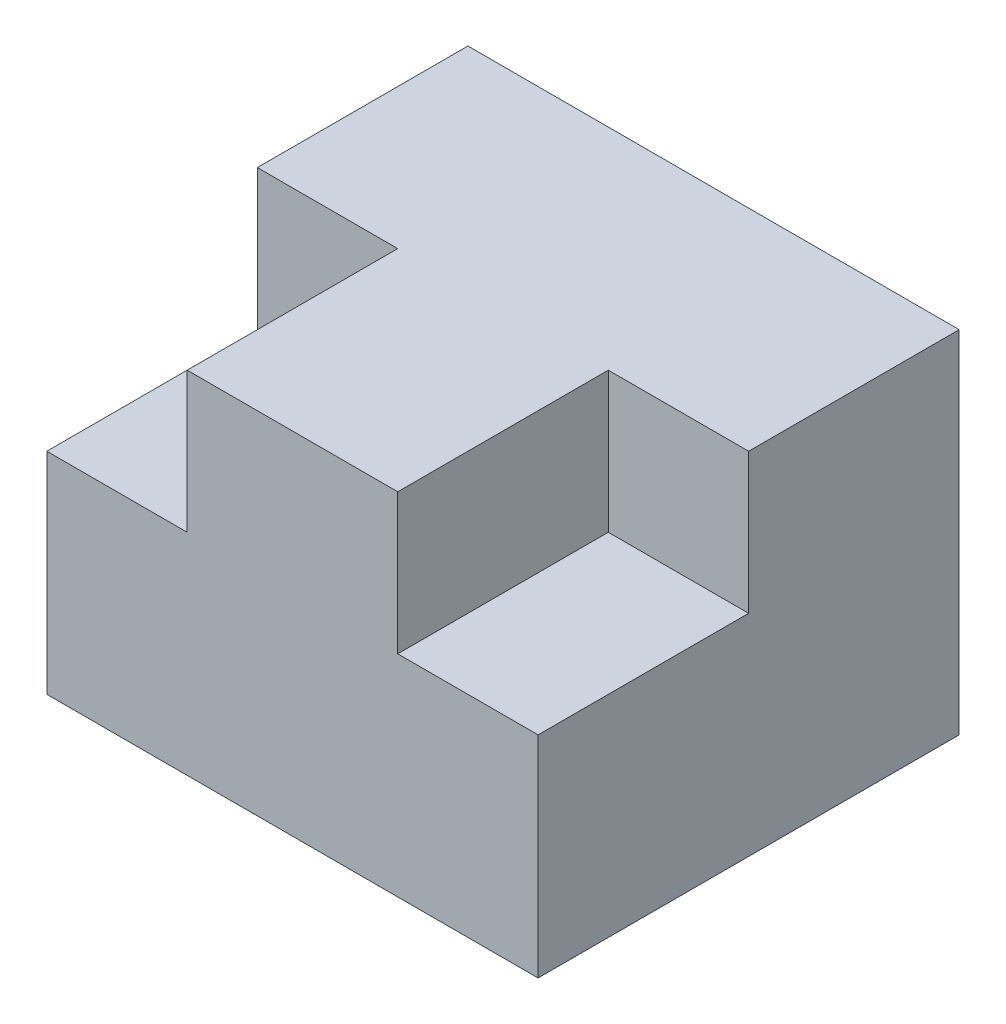
ISO-10303-21;
HEADER;
FILE_DESCRIPTION(('STEP AP214'),'2;1');
FILE_NAME('part.step','',(''),(''),'','','');
FILE_SCHEMA(('AUTOMOTIVE_DESIGN { 1 0 10303 214 1 1 1 1 }'));
ENDSEC;
DATA;
#1=APPLICATION_CONTEXT('core data for automotive mechanical design processes');
#2=APPLICATION_PROTOCOL_DEFINITION('international standard','automotive_design',2000,#1);
#3=PRODUCT_CONTEXT('',#1,'mechanical');
#4=PRODUCT('Part','Part','',(#3));
#5=PRODUCT_RELATED_PRODUCT_CATEGORY('part','',(#4));
#6=PRODUCT_DEFINITION_FORMATION('','',#4);
#7=PRODUCT_DEFINITION_CONTEXT('part definition',#1,'design');
#8=PRODUCT_DEFINITION('design','',#6,#7);
#9=PRODUCT_DEFINITION_SHAPE('','',#8);
#10=(LENGTH_UNIT() NAMED_UNIT(*) SI_UNIT(.MILLI.,.METRE.));
#11=(NAMED_UNIT(*) PLANE_ANGLE_UNIT() SI_UNIT($,.RADIAN.));
#12=(NAMED_UNIT(*) SI_UNIT($,.STERADIAN.) SOLID_ANGLE_UNIT());
#13=UNCERTAINTY_MEASURE_WITH_UNIT(LENGTH_MEASURE(1.E-05),#10,'distance_accuracy_value','');
#14=(GEOMETRIC_REPRESENTATION_CONTEXT(3) GLOBAL_UNCERTAINTY_ASSIGNED_CONTEXT((#13)) GLOBAL_UNIT_ASSIGNED_CONTEXT((#10,
#11,#12)) REPRESENTATION_CONTEXT('',''));
#15=CARTESIAN_POINT('',(0.,0.,0.));
#16=DIRECTION('',(0.,0.,1.));
#17=DIRECTION('',(1.,0.,0.));
#18=AXIS2_PLACEMENT_3D('',#15,#16,#17);
#19=CARTESIAN_POINT('',(0.,0.,0.));
#20=DIRECTION('',(0.,0.,1.));
#21=DIRECTION('',(1.,0.,0.));
#22=AXIS2_PLACEMENT_3D('',#19,#20,#21);
#23=PLANE('',#22);
#24=DIRECTION('',(-1.,0.,0.));
#25=VECTOR('',#24,1.);
#26=CARTESIAN_POINT('',(-23.277889772719,2.53993610223643,0.));
#27=LINE('',#26,#25);
#28=CARTESIAN_POINT('',(-13.277889772719,2.53993610223642,0.));
#29=VERTEX_POINT('',#28);
#30=CARTESIAN_POINT('',(-23.277889772719,2.53993610223643,0.));
#31=VERTEX_POINT('',#30);
#32=EDGE_CURVE('E61',#29,#31,#27,.T.);
#33=ORIENTED_EDGE('',*,*,#32,.F.);
#34=DIRECTION('',(0.,-1.,0.));
#35=VECTOR('',#34,1.);
#36=CARTESIAN_POINT('',(-13.277889772719,2.53993610223642,0.));
#37=LINE('',#36,#35);
#38=CARTESIAN_POINT('',(-13.277889772719,12.5399361022364,0.));
#39=VERTEX_POINT('',#38);
#40=EDGE_CURVE('E65',#39,#29,#37,.T.);
#41=ORIENTED_EDGE('',*,*,#40,.F.);
#42=DIRECTION('',(-1.,0.,0.));
#43=VECTOR('',#42,1.);
#44=CARTESIAN_POINT('',(-23.277889772719,12.5399361022364,0.));
#45=LINE('',#44,#43);
#46=CARTESIAN_POINT('',(-23.277889772719,12.5399361022364,0.));
#47=VERTEX_POINT('',#46);
#48=EDGE_CURVE('E177',#39,#47,#45,.T.);
#49=ORIENTED_EDGE('',*,*,#48,.T.);
#50=DIRECTION('',(0.,-1.,0.));
#51=VECTOR('',#50,1.);
#52=CARTESIAN_POINT('',(-23.277889772719,12.5399361022364,0.));
#53=LINE('',#52,#51);
#54=EDGE_CURVE('E149',#47,#31,#53,.T.);
#55=ORIENTED_EDGE('',*,*,#54,.T.);
#56=EDGE_LOOP('',(#33,#41,#49,#55));
#57=FACE_BOUND('',#56,.T.);
#58=ADVANCED_FACE('F43',(#57),#23,.T.);
#59=CARTESIAN_POINT('',(-23.277889772719,12.5399361022364,-15.));
#60=DIRECTION('',(-1.,0.,0.));
#61=DIRECTION('',(0.,-1.,0.));
#62=AXIS2_PLACEMENT_3D('',#59,#60,#61);
#63=PLANE('',#62);
#64=ORIENTED_EDGE('',*,*,#54,.F.);
#65=DIRECTION('',(0.,0.,1.));
#66=VECTOR('',#65,1.);
#67=CARTESIAN_POINT('',(-23.277889772719,12.5399361022364,-15.));
#68=LINE('',#67,#66);
#69=CARTESIAN_POINT('',(-23.277889772719,12.5399361022364,-15.));
#70=VERTEX_POINT('',#69);
#71=EDGE_CURVE('E11',#70,#47,#68,.T.);
#72=ORIENTED_EDGE('',*,*,#71,.F.);
#73=DIRECTION('',(0.,-1.,0.));
#74=VECTOR('',#73,1.);
#75=CARTESIAN_POINT('',(-23.277889772719,12.5399361022364,-15.));
#76=LINE('',#75,#74);
#77=CARTESIAN_POINT('',(-23.277889772719,-12.4600638977636,-15.));
#78=VERTEX_POINT('',#77);
#79=EDGE_CURVE('E158',#70,#78,#76,.T.);
#80=ORIENTED_EDGE('',*,*,#79,.T.);
#81=DIRECTION('',(0.,0.,1.));
#82=VECTOR('',#81,1.);
#83=CARTESIAN_POINT('',(-23.277889772719,-12.4600638977636,-15.));
#84=LINE('',#83,#82);
#85=CARTESIAN_POINT('',(-23.277889772719,-12.4600638977636,15.));
#86=VERTEX_POINT('',#85);
#87=EDGE_CURVE('E47',#78,#86,#84,.T.);
#88=ORIENTED_EDGE('',*,*,#87,.T.);
#89=DIRECTION('',(0.,-1.,0.));
#90=VECTOR('',#89,1.);
#91=CARTESIAN_POINT('',(-23.277889772719,-12.4600638977636,15.));
#92=LINE('',#91,#90);
#93=CARTESIAN_POINT('',(-23.277889772719,2.53993610223643,15.));
#94=VERTEX_POINT('',#93);
#95=EDGE_CURVE('E189',#94,#86,#92,.T.);
#96=ORIENTED_EDGE('',*,*,#95,.F.);
#97=DIRECTION('',(0.,0.,-1.));
#98=VECTOR('',#97,1.);
#99=CARTESIAN_POINT('',(-23.277889772719,2.53993610223643,15.));
#100=LINE('',#99,#98);
#101=EDGE_CURVE('E199',#94,#31,#100,.T.);
#102=ORIENTED_EDGE('',*,*,#101,.T.);
#103=EDGE_LOOP('',(#64,#72,#80,#88,#96,#102));
#104=FACE_BOUND('',#103,.T.);
#105=ADVANCED_FACE('F45',(#104),#63,.T.);
#106=CARTESIAN_POINT('',(-23.277889772719,12.5399361022364,-15.));
#107=DIRECTION('',(0.,1.,0.));
#108=DIRECTION('',(0.,0.,1.));
#109=AXIS2_PLACEMENT_3D('',#106,#107,#108);
#110=PLANE('',#109);
#111=CARTESIAN_POINT('',(11.722110227281,12.5399361022364,0.));
#112=VERTEX_POINT('',#111);
#113=CARTESIAN_POINT('',(1.72211022728101,12.5399361022364,0.));
#114=VERTEX_POINT('',#113);
#115=EDGE_CURVE('E163',#112,#114,#45,.T.);
#116=ORIENTED_EDGE('',*,*,#115,.F.);
#117=DIRECTION('',(0.,0.,1.));
#118=VECTOR('',#117,1.);
#119=CARTESIAN_POINT('',(11.722110227281,12.5399361022364,-15.));
#120=LINE('',#119,#118);
#121=CARTESIAN_POINT('',(11.722110227281,12.5399361022364,-15.));
#122=VERTEX_POINT('',#121);
#123=EDGE_CURVE('E53',#122,#112,#120,.T.);
#124=ORIENTED_EDGE('',*,*,#123,.F.);
#125=DIRECTION('',(-1.,0.,0.));
#126=VECTOR('',#125,1.);
#127=CARTESIAN_POINT('',(-23.277889772719,12.5399361022364,-15.));
#128=LINE('',#127,#126);
#129=EDGE_CURVE('E171',#122,#70,#128,.T.);
#130=ORIENTED_EDGE('',*,*,#129,.T.);
#131=ORIENTED_EDGE('',*,*,#71,.T.);
#132=ORIENTED_EDGE('',*,*,#48,.F.);
#133=DIRECTION('',(0.,0.,-1.));
#134=VECTOR('',#133,1.);
#135=CARTESIAN_POINT('',(-13.277889772719,12.5399361022364,15.));
#136=LINE('',#135,#134);
#137=CARTESIAN_POINT('',(-13.277889772719,12.5399361022364,15.));
#138=VERTEX_POINT('',#137);
#139=EDGE_CURVE('E220',#138,#39,#136,.T.);
#140=ORIENTED_EDGE('',*,*,#139,.F.);
#141=DIRECTION('',(-1.,0.,0.));
#142=VECTOR('',#141,1.);
#143=CARTESIAN_POINT('',(-13.277889772719,12.5399361022364,15.));
#144=LINE('',#143,#142);
#145=CARTESIAN_POINT('',(1.72211022728101,12.5399361022364,15.));
#146=VERTEX_POINT('',#145);
#147=EDGE_CURVE('E231',#146,#138,#144,.T.);
#148=ORIENTED_EDGE('',*,*,#147,.F.);
#149=DIRECTION('',(0.,0.,-1.));
#150=VECTOR('',#149,1.);
#151=CARTESIAN_POINT('',(1.72211022728101,12.5399361022364,15.));
#152=LINE('',#151,#150);
#153=EDGE_CURVE('E154',#146,#114,#152,.T.);
#154=ORIENTED_EDGE('',*,*,#153,.T.);
#155=EDGE_LOOP('',(#116,#124,#130,#131,#132,#140,#148,#154));
#156=FACE_BOUND('',#155,.T.);
#157=ADVANCED_FACE('F229',(#156),#110,.T.);
#158=CARTESIAN_POINT('',(11.722110227281,12.5399361022364,-15.));
#159=DIRECTION('',(1.,0.,0.));
#160=DIRECTION('',(0.,0.,-1.));
#161=AXIS2_PLACEMENT_3D('',#158,#159,#160);
#162=PLANE('',#161);
#163=DIRECTION('',(0.,1.,0.));
#164=VECTOR('',#163,1.);
#165=CARTESIAN_POINT('',(11.722110227281,12.5399361022364,0.));
#166=LINE('',#165,#164);
#167=CARTESIAN_POINT('',(11.722110227281,2.53993610223643,0.));
#168=VERTEX_POINT('',#167);
#169=EDGE_CURVE('E147',#168,#112,#166,.T.);
#170=ORIENTED_EDGE('',*,*,#169,.F.);
#171=DIRECTION('',(0.,0.,-1.));
#172=VECTOR('',#171,1.);
#173=CARTESIAN_POINT('',(11.722110227281,2.53993610223643,15.));
#174=LINE('',#173,#172);
#175=CARTESIAN_POINT('',(11.722110227281,2.53993610223643,15.));
#176=VERTEX_POINT('',#175);
#177=EDGE_CURVE('E126',#176,#168,#174,.T.);
#178=ORIENTED_EDGE('',*,*,#177,.F.);
#179=DIRECTION('',(0.,1.,0.));
#180=VECTOR('',#179,1.);
#181=CARTESIAN_POINT('',(11.722110227281,-12.4600638977636,15.));
#182=LINE('',#181,#180);
#183=CARTESIAN_POINT('',(11.722110227281,-12.4600638977636,15.));
#184=VERTEX_POINT('',#183);
#185=EDGE_CURVE('E133',#184,#176,#182,.T.);
#186=ORIENTED_EDGE('',*,*,#185,.F.);
#187=DIRECTION('',(0.,0.,1.));
#188=VECTOR('',#187,1.);
#189=CARTESIAN_POINT('',(11.722110227281,-12.4600638977636,-15.));
#190=LINE('',#189,#188);
#191=CARTESIAN_POINT('',(11.722110227281,-12.4600638977636,-15.));
#192=VERTEX_POINT('',#191);
#193=EDGE_CURVE('E181',#192,#184,#190,.T.);
#194=ORIENTED_EDGE('',*,*,#193,.F.);
#195=DIRECTION('',(0.,1.,0.));
#196=VECTOR('',#195,1.);
#197=CARTESIAN_POINT('',(11.722110227281,12.5399361022364,-15.));
#198=LINE('',#197,#196);
#199=EDGE_CURVE('E167',#192,#122,#198,.T.);
#200=ORIENTED_EDGE('',*,*,#199,.T.);
#201=ORIENTED_EDGE('',*,*,#123,.T.);
#202=EDGE_LOOP('',(#170,#178,#186,#194,#200,#201));
#203=FACE_BOUND('',#202,.T.);
#204=ADVANCED_FACE('F145',(#203),#162,.T.);
#205=CARTESIAN_POINT('',(-23.277889772719,-12.4600638977636,-15.));
#206=DIRECTION('',(0.,-1.,0.));
#207=DIRECTION('',(1.,0.,0.));
#208=AXIS2_PLACEMENT_3D('',#205,#206,#207);
#209=PLANE('',#208);
#210=ORIENTED_EDGE('',*,*,#193,.T.);
#211=DIRECTION('',(1.,0.,0.));
#212=VECTOR('',#211,1.);
#213=CARTESIAN_POINT('',(-23.277889772719,-12.4600638977636,15.));
#214=LINE('',#213,#212);
#215=EDGE_CURVE('E140',#86,#184,#214,.T.);
#216=ORIENTED_EDGE('',*,*,#215,.F.);
#217=ORIENTED_EDGE('',*,*,#87,.F.);
#218=DIRECTION('',(1.,0.,0.));
#219=VECTOR('',#218,1.);
#220=CARTESIAN_POINT('',(-23.277889772719,-12.4600638977636,-15.));
#221=LINE('',#220,#219);
#222=EDGE_CURVE('E162',#78,#192,#221,.T.);
#223=ORIENTED_EDGE('',*,*,#222,.T.);
#224=EDGE_LOOP('',(#210,#216,#217,#223));
#225=FACE_BOUND('',#224,.T.);
#226=ADVANCED_FACE('F197',(#225),#209,.T.);
#227=CARTESIAN_POINT('',(0.,0.,-15.));
#228=DIRECTION('',(0.,0.,1.));
#229=DIRECTION('',(1.,0.,0.));
#230=AXIS2_PLACEMENT_3D('',#227,#228,#229);
#231=PLANE('',#230);
#232=ORIENTED_EDGE('',*,*,#79,.F.);
#233=ORIENTED_EDGE('',*,*,#129,.F.);
#234=ORIENTED_EDGE('',*,*,#199,.F.);
#235=ORIENTED_EDGE('',*,*,#222,.F.);
#236=EDGE_LOOP('',(#232,#233,#234,#235));
#237=FACE_BOUND('',#236,.T.);
#238=ADVANCED_FACE('F239',(#237),#231,.F.);
#239=DIRECTION('',(0.,1.,0.));
#240=VECTOR('',#239,1.);
#241=CARTESIAN_POINT('',(1.72211022728101,2.53993610223643,0.));
#242=LINE('',#241,#240);
#243=CARTESIAN_POINT('',(1.72211022728101,2.53993610223643,0.));
#244=VERTEX_POINT('',#243);
#245=EDGE_CURVE('E209',#244,#114,#242,.T.);
#246=ORIENTED_EDGE('',*,*,#245,.F.);
#247=DIRECTION('',(-1.,0.,0.));
#248=VECTOR('',#247,1.);
#249=CARTESIAN_POINT('',(11.722110227281,2.53993610223643,0.));
#250=LINE('',#249,#248);
#251=EDGE_CURVE('E206',#168,#244,#250,.T.);
#252=ORIENTED_EDGE('',*,*,#251,.F.);
#253=ORIENTED_EDGE('',*,*,#169,.T.);
#254=ORIENTED_EDGE('',*,*,#115,.T.);
#255=EDGE_LOOP('',(#246,#252,#253,#254));
#256=FACE_BOUND('',#255,.T.);
#257=ADVANCED_FACE('F235',(#256),#23,.T.);
#258=CARTESIAN_POINT('',(11.722110227281,2.53993610223643,15.));
#259=DIRECTION('',(0.,-1.,0.));
#260=DIRECTION('',(1.,0.,0.));
#261=AXIS2_PLACEMENT_3D('',#258,#259,#260);
#262=PLANE('',#261);
#263=ORIENTED_EDGE('',*,*,#251,.T.);
#264=DIRECTION('',(0.,0.,-1.));
#265=VECTOR('',#264,1.);
#266=CARTESIAN_POINT('',(1.72211022728101,2.53993610223643,15.));
#267=LINE('',#266,#265);
#268=CARTESIAN_POINT('',(1.72211022728101,2.53993610223643,15.));
#269=VERTEX_POINT('',#268);
#270=EDGE_CURVE('E128',#269,#244,#267,.T.);
#271=ORIENTED_EDGE('',*,*,#270,.F.);
#272=DIRECTION('',(-1.,0.,0.));
#273=VECTOR('',#272,1.);
#274=CARTESIAN_POINT('',(11.722110227281,2.53993610223643,15.));
#275=LINE('',#274,#273);
#276=EDGE_CURVE('E121',#176,#269,#275,.T.);
#277=ORIENTED_EDGE('',*,*,#276,.F.);
#278=ORIENTED_EDGE('',*,*,#177,.T.);
#279=EDGE_LOOP('',(#263,#271,#277,#278));
#280=FACE_BOUND('',#279,.T.);
#281=ADVANCED_FACE('F124',(#280),#262,.F.);
#282=CARTESIAN_POINT('',(1.72211022728101,2.53993610223643,15.));
#283=DIRECTION('',(-1.,0.,0.));
#284=DIRECTION('',(0.,0.,1.));
#285=AXIS2_PLACEMENT_3D('',#282,#283,#284);
#286=PLANE('',#285);
#287=ORIENTED_EDGE('',*,*,#245,.T.);
#288=ORIENTED_EDGE('',*,*,#153,.F.);
#289=DIRECTION('',(0.,1.,0.));
#290=VECTOR('',#289,1.);
#291=CARTESIAN_POINT('',(1.72211022728101,2.53993610223643,15.));
#292=LINE('',#291,#290);
#293=EDGE_CURVE('E132',#269,#146,#292,.T.);
#294=ORIENTED_EDGE('',*,*,#293,.F.);
#295=ORIENTED_EDGE('',*,*,#270,.T.);
#296=EDGE_LOOP('',(#287,#288,#294,#295));
#297=FACE_BOUND('',#296,.T.);
#298=ADVANCED_FACE('F233',(#297),#286,.F.);
#299=CARTESIAN_POINT('',(-13.277889772719,2.53993610223642,15.));
#300=DIRECTION('',(1.,0.,0.));
#301=DIRECTION('',(0.,1.,0.));
#302=AXIS2_PLACEMENT_3D('',#299,#300,#301);
#303=PLANE('',#302);
#304=ORIENTED_EDGE('',*,*,#40,.T.);
#305=DIRECTION('',(0.,0.,-1.));
#306=VECTOR('',#305,1.);
#307=CARTESIAN_POINT('',(-13.277889772719,2.53993610223642,15.));
#308=LINE('',#307,#306);
#309=CARTESIAN_POINT('',(-13.277889772719,2.53993610223642,15.));
#310=VERTEX_POINT('',#309);
#311=EDGE_CURVE('E202',#310,#29,#308,.T.);
#312=ORIENTED_EDGE('',*,*,#311,.F.);
#313=DIRECTION('',(0.,-1.,0.));
#314=VECTOR('',#313,1.);
#315=CARTESIAN_POINT('',(-13.277889772719,2.53993610223642,15.));
#316=LINE('',#315,#314);
#317=EDGE_CURVE('E376',#138,#310,#316,.T.);
#318=ORIENTED_EDGE('',*,*,#317,.F.);
#319=ORIENTED_EDGE('',*,*,#139,.T.);
#320=EDGE_LOOP('',(#304,#312,#318,#319));
#321=FACE_BOUND('',#320,.T.);
#322=ADVANCED_FACE('F291',(#321),#303,.F.);
#323=CARTESIAN_POINT('',(-23.277889772719,2.53993610223643,15.));
#324=DIRECTION('',(0.,-1.,0.));
#325=DIRECTION('',(1.,0.,0.));
#326=AXIS2_PLACEMENT_3D('',#323,#324,#325);
#327=PLANE('',#326);
#328=ORIENTED_EDGE('',*,*,#32,.T.);
#329=ORIENTED_EDGE('',*,*,#101,.F.);
#330=DIRECTION('',(-1.,0.,0.));
#331=VECTOR('',#330,1.);
#332=CARTESIAN_POINT('',(-23.277889772719,2.53993610223643,15.));
#333=LINE('',#332,#331);
#334=EDGE_CURVE('E193',#310,#94,#333,.T.);
#335=ORIENTED_EDGE('',*,*,#334,.F.);
#336=ORIENTED_EDGE('',*,*,#311,.T.);
#337=EDGE_LOOP('',(#328,#329,#335,#336));
#338=FACE_BOUND('',#337,.T.);
#339=ADVANCED_FACE('F301',(#338),#327,.F.);
#340=CARTESIAN_POINT('',(0.,0.,15.));
#341=DIRECTION('',(0.,0.,1.));
#342=DIRECTION('',(1.,0.,0.));
#343=AXIS2_PLACEMENT_3D('',#340,#341,#342);
#344=PLANE('',#343);
#345=ORIENTED_EDGE('',*,*,#185,.T.);
#346=ORIENTED_EDGE('',*,*,#276,.T.);
#347=ORIENTED_EDGE('',*,*,#293,.T.);
#348=ORIENTED_EDGE('',*,*,#147,.T.);
#349=ORIENTED_EDGE('',*,*,#317,.T.);
#350=ORIENTED_EDGE('',*,*,#334,.T.);
#351=ORIENTED_EDGE('',*,*,#95,.T.);
#352=ORIENTED_EDGE('',*,*,#215,.T.);
#353=EDGE_LOOP('',(#345,#346,#347,#348,#349,#350,#351,#352));
#354=FACE_BOUND('',#353,.T.);
#355=ADVANCED_FACE('F137',(#354),#344,.T.);
#356=CLOSED_SHELL('',(#58,#105,#157,#204,#226,#238,#257,#281,#298,#322,#339,#355));
#357=MANIFOLD_SOLID_BREP('B2',#356);
#358=ADVANCED_BREP_SHAPE_REPRESENTATION('',(#18,#357),#14);
#359=SHAPE_DEFINITION_REPRESENTATION(#9,#358);
ENDSEC;
END-ISO-10303-21;
